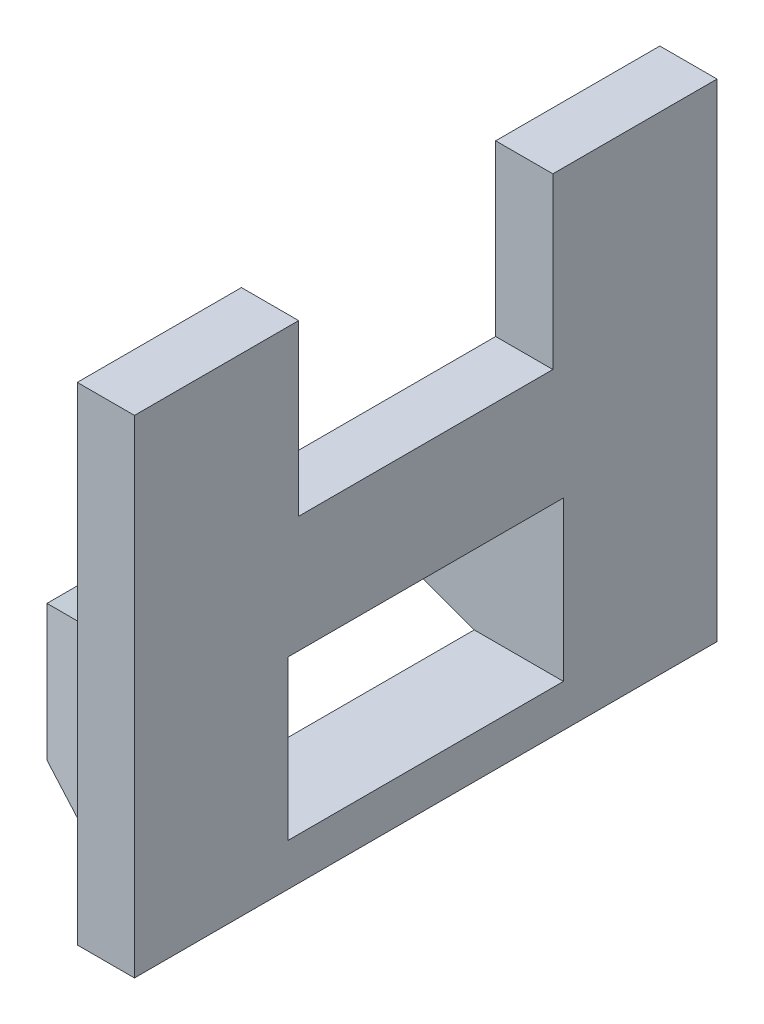
ISO-10303-21;
HEADER;
FILE_DESCRIPTION(('STEP AP214'),'2;1');
FILE_NAME('part.step','',(''),(''),'','','');
FILE_SCHEMA(('AUTOMOTIVE_DESIGN { 1 0 10303 214 1 1 1 1 }'));
ENDSEC;
DATA;
#1=APPLICATION_CONTEXT('core data for automotive mechanical design processes');
#2=APPLICATION_PROTOCOL_DEFINITION('international standard','automotive_design',2000,#1);
#3=PRODUCT_CONTEXT('',#1,'mechanical');
#4=PRODUCT('Part','Part','',(#3));
#5=PRODUCT_RELATED_PRODUCT_CATEGORY('part','',(#4));
#6=PRODUCT_DEFINITION_FORMATION('','',#4);
#7=PRODUCT_DEFINITION_CONTEXT('part definition',#1,'design');
#8=PRODUCT_DEFINITION('design','',#6,#7);
#9=PRODUCT_DEFINITION_SHAPE('','',#8);
#10=(LENGTH_UNIT() NAMED_UNIT(*) SI_UNIT(.MILLI.,.METRE.));
#11=(NAMED_UNIT(*) PLANE_ANGLE_UNIT() SI_UNIT($,.RADIAN.));
#12=(NAMED_UNIT(*) SI_UNIT($,.STERADIAN.) SOLID_ANGLE_UNIT());
#13=UNCERTAINTY_MEASURE_WITH_UNIT(LENGTH_MEASURE(1.E-05),#10,'distance_accuracy_value','');
#14=(GEOMETRIC_REPRESENTATION_CONTEXT(3) GLOBAL_UNCERTAINTY_ASSIGNED_CONTEXT((#13)) GLOBAL_UNIT_ASSIGNED_CONTEXT((#10,
#11,#12)) REPRESENTATION_CONTEXT('',''));
#15=CARTESIAN_POINT('',(0.,0.,0.));
#16=DIRECTION('',(0.,0.,1.));
#17=DIRECTION('',(1.,0.,0.));
#18=AXIS2_PLACEMENT_3D('',#15,#16,#17);
#19=CARTESIAN_POINT('',(-2.7,0.,0.));
#20=DIRECTION('',(1.,0.,0.));
#21=DIRECTION('',(0.,0.,-1.));
#22=AXIS2_PLACEMENT_3D('',#19,#20,#21);
#23=PLANE('',#22);
#24=DIRECTION('',(0.,0.,-1.));
#25=VECTOR('',#24,1.);
#26=CARTESIAN_POINT('',(-2.7,3.5,6.));
#27=LINE('',#26,#25);
#28=CARTESIAN_POINT('',(-2.7,3.5,6.));
#29=VERTEX_POINT('',#28);
#30=CARTESIAN_POINT('',(-2.7,3.5,-6.));
#31=VERTEX_POINT('',#30);
#32=EDGE_CURVE('E256',#29,#31,#27,.T.);
#33=ORIENTED_EDGE('',*,*,#32,.T.);
#34=DIRECTION('',(0.,1.,0.));
#35=VECTOR('',#34,1.);
#36=CARTESIAN_POINT('',(-2.7,3.5,-6.));
#37=LINE('',#36,#35);
#38=CARTESIAN_POINT('',(-2.7,11.5,-6.));
#39=VERTEX_POINT('',#38);
#40=EDGE_CURVE('E261',#31,#39,#37,.T.);
#41=ORIENTED_EDGE('',*,*,#40,.T.);
#42=DIRECTION('',(0.,0.,1.));
#43=VECTOR('',#42,1.);
#44=CARTESIAN_POINT('',(-2.7,11.5,13.75));
#45=LINE('',#44,#43);
#46=CARTESIAN_POINT('',(-2.7,11.5,-13.75));
#47=VERTEX_POINT('',#46);
#48=EDGE_CURVE('E294',#47,#39,#45,.T.);
#49=ORIENTED_EDGE('',*,*,#48,.F.);
#50=DIRECTION('',(0.,1.,0.));
#51=VECTOR('',#50,1.);
#52=CARTESIAN_POINT('',(-2.7,11.5,-13.75));
#53=LINE('',#52,#51);
#54=CARTESIAN_POINT('',(-2.7,-11.5,-13.75));
#55=VERTEX_POINT('',#54);
#56=EDGE_CURVE('E288',#55,#47,#53,.T.);
#57=ORIENTED_EDGE('',*,*,#56,.F.);
#58=DIRECTION('',(0.,0.,-1.));
#59=VECTOR('',#58,1.);
#60=CARTESIAN_POINT('',(-2.7,-11.5,13.75));
#61=LINE('',#60,#59);
#62=CARTESIAN_POINT('',(-2.7,-11.5,13.75));
#63=VERTEX_POINT('',#62);
#64=EDGE_CURVE('E302',#63,#55,#61,.T.);
#65=ORIENTED_EDGE('',*,*,#64,.F.);
#66=DIRECTION('',(0.,-1.,0.));
#67=VECTOR('',#66,1.);
#68=CARTESIAN_POINT('',(-2.7,11.5,13.75));
#69=LINE('',#68,#67);
#70=CARTESIAN_POINT('',(-2.7,11.5,13.75));
#71=VERTEX_POINT('',#70);
#72=EDGE_CURVE('E298',#71,#63,#69,.T.);
#73=ORIENTED_EDGE('',*,*,#72,.F.);
#74=CARTESIAN_POINT('',(-2.7,11.5,6.));
#75=VERTEX_POINT('',#74);
#76=EDGE_CURVE('E292',#75,#71,#45,.T.);
#77=ORIENTED_EDGE('',*,*,#76,.F.);
#78=DIRECTION('',(0.,-1.,0.));
#79=VECTOR('',#78,1.);
#80=CARTESIAN_POINT('',(-2.7,11.5,6.));
#81=LINE('',#80,#79);
#82=EDGE_CURVE('E252',#75,#29,#81,.T.);
#83=ORIENTED_EDGE('',*,*,#82,.T.);
#84=EDGE_LOOP('',(#33,#41,#49,#57,#65,#73,#77,#83));
#85=FACE_BOUND('',#84,.T.);
#86=DIRECTION('',(0.,-1.,0.));
#87=VECTOR('',#86,1.);
#88=CARTESIAN_POINT('',(-2.7,0.,-12.));
#89=LINE('',#88,#87);
#90=CARTESIAN_POINT('',(-2.7,0.,-12.));
#91=VERTEX_POINT('',#90);
#92=CARTESIAN_POINT('',(-2.7,-10.05,-12.));
#93=VERTEX_POINT('',#92);
#94=EDGE_CURVE('E204',#91,#93,#89,.T.);
#95=ORIENTED_EDGE('',*,*,#94,.F.);
#96=DIRECTION('',(0.,0.,-1.));
#97=VECTOR('',#96,1.);
#98=CARTESIAN_POINT('',(-2.7,0.,-12.));
#99=LINE('',#98,#97);
#100=CARTESIAN_POINT('',(-2.7,0.,12.));
#101=VERTEX_POINT('',#100);
#102=EDGE_CURVE('E216',#101,#91,#99,.T.);
#103=ORIENTED_EDGE('',*,*,#102,.F.);
#104=DIRECTION('',(0.,1.,0.));
#105=VECTOR('',#104,1.);
#106=CARTESIAN_POINT('',(-2.7,0.,12.));
#107=LINE('',#106,#105);
#108=CARTESIAN_POINT('',(-2.7,-10.05,12.));
#109=VERTEX_POINT('',#108);
#110=EDGE_CURVE('E212',#109,#101,#107,.T.);
#111=ORIENTED_EDGE('',*,*,#110,.F.);
#112=DIRECTION('',(0.,0.,1.));
#113=VECTOR('',#112,1.);
#114=CARTESIAN_POINT('',(-2.7,-10.05,-12.));
#115=LINE('',#114,#113);
#116=EDGE_CURVE('E208',#93,#109,#115,.T.);
#117=ORIENTED_EDGE('',*,*,#116,.F.);
#118=EDGE_LOOP('',(#95,#103,#111,#117));
#119=FACE_BOUND('',#118,.T.);
#120=ADVANCED_FACE('F39',(#85,#119),#23,.F.);
#121=CARTESIAN_POINT('',(-2.7,11.5,13.75));
#122=DIRECTION('',(0.,1.,0.));
#123=DIRECTION('',(0.,0.,1.));
#124=AXIS2_PLACEMENT_3D('',#121,#122,#123);
#125=PLANE('',#124);
#126=DIRECTION('',(1.,0.,0.));
#127=VECTOR('',#126,1.);
#128=CARTESIAN_POINT('',(-2.7,11.5,-6.));
#129=LINE('',#128,#127);
#130=CARTESIAN_POINT('',(0.,11.5,-6.));
#131=VERTEX_POINT('',#130);
#132=EDGE_CURVE('E275',#39,#131,#129,.T.);
#133=ORIENTED_EDGE('',*,*,#132,.T.);
#134=DIRECTION('',(0.,0.,1.));
#135=VECTOR('',#134,1.);
#136=CARTESIAN_POINT('',(0.,11.5,13.75));
#137=LINE('',#136,#135);
#138=CARTESIAN_POINT('',(0.,11.5,-13.75));
#139=VERTEX_POINT('',#138);
#140=EDGE_CURVE('E311',#139,#131,#137,.T.);
#141=ORIENTED_EDGE('',*,*,#140,.F.);
#142=DIRECTION('',(1.,0.,0.));
#143=VECTOR('',#142,1.);
#144=CARTESIAN_POINT('',(-2.7,11.5,-13.75));
#145=LINE('',#144,#143);
#146=EDGE_CURVE('E306',#47,#139,#145,.T.);
#147=ORIENTED_EDGE('',*,*,#146,.F.);
#148=ORIENTED_EDGE('',*,*,#48,.T.);
#149=EDGE_LOOP('',(#133,#141,#147,#148));
#150=FACE_BOUND('',#149,.T.);
#151=ADVANCED_FACE('F393',(#150),#125,.T.);
#152=CARTESIAN_POINT('',(-2.7,11.5,-13.75));
#153=DIRECTION('',(0.,0.,-1.));
#154=DIRECTION('',(0.,1.,0.));
#155=AXIS2_PLACEMENT_3D('',#152,#153,#154);
#156=PLANE('',#155);
#157=DIRECTION('',(0.,1.,0.));
#158=VECTOR('',#157,1.);
#159=CARTESIAN_POINT('',(0.,11.5,-13.75));
#160=LINE('',#159,#158);
#161=CARTESIAN_POINT('',(0.,-11.5,-13.75));
#162=VERTEX_POINT('',#161);
#163=EDGE_CURVE('E279',#162,#139,#160,.T.);
#164=ORIENTED_EDGE('',*,*,#163,.F.);
#165=DIRECTION('',(1.,0.,0.));
#166=VECTOR('',#165,1.);
#167=CARTESIAN_POINT('',(-2.7,-11.5,-13.75));
#168=LINE('',#167,#166);
#169=EDGE_CURVE('E322',#55,#162,#168,.T.);
#170=ORIENTED_EDGE('',*,*,#169,.F.);
#171=ORIENTED_EDGE('',*,*,#56,.T.);
#172=ORIENTED_EDGE('',*,*,#146,.T.);
#173=EDGE_LOOP('',(#164,#170,#171,#172));
#174=FACE_BOUND('',#173,.T.);
#175=ADVANCED_FACE('F41',(#174),#156,.T.);
#176=CARTESIAN_POINT('',(-2.7,-11.5,13.75));
#177=DIRECTION('',(0.,-1.,0.));
#178=DIRECTION('',(0.,0.,-1.));
#179=AXIS2_PLACEMENT_3D('',#176,#177,#178);
#180=PLANE('',#179);
#181=DIRECTION('',(0.,0.,-1.));
#182=VECTOR('',#181,1.);
#183=CARTESIAN_POINT('',(0.,-11.5,13.75));
#184=LINE('',#183,#182);
#185=CARTESIAN_POINT('',(0.,-11.5,13.75));
#186=VERTEX_POINT('',#185);
#187=EDGE_CURVE('E293',#186,#162,#184,.T.);
#188=ORIENTED_EDGE('',*,*,#187,.F.);
#189=DIRECTION('',(1.,0.,0.));
#190=VECTOR('',#189,1.);
#191=CARTESIAN_POINT('',(-2.7,-11.5,13.75));
#192=LINE('',#191,#190);
#193=EDGE_CURVE('E326',#63,#186,#192,.T.);
#194=ORIENTED_EDGE('',*,*,#193,.F.);
#195=ORIENTED_EDGE('',*,*,#64,.T.);
#196=ORIENTED_EDGE('',*,*,#169,.T.);
#197=EDGE_LOOP('',(#188,#194,#195,#196));
#198=FACE_BOUND('',#197,.T.);
#199=ADVANCED_FACE('F378',(#198),#180,.T.);
#200=CARTESIAN_POINT('',(-2.7,11.5,13.75));
#201=DIRECTION('',(0.,0.,1.));
#202=DIRECTION('',(0.,-1.,0.));
#203=AXIS2_PLACEMENT_3D('',#200,#201,#202);
#204=PLANE('',#203);
#205=DIRECTION('',(0.,-1.,0.));
#206=VECTOR('',#205,1.);
#207=CARTESIAN_POINT('',(0.,11.5,13.75));
#208=LINE('',#207,#206);
#209=CARTESIAN_POINT('',(0.,11.5,13.75));
#210=VERTEX_POINT('',#209);
#211=EDGE_CURVE('E315',#210,#186,#208,.T.);
#212=ORIENTED_EDGE('',*,*,#211,.F.);
#213=DIRECTION('',(1.,0.,0.));
#214=VECTOR('',#213,1.);
#215=CARTESIAN_POINT('',(-2.7,11.5,13.75));
#216=LINE('',#215,#214);
#217=EDGE_CURVE('E329',#71,#210,#216,.T.);
#218=ORIENTED_EDGE('',*,*,#217,.F.);
#219=ORIENTED_EDGE('',*,*,#72,.T.);
#220=ORIENTED_EDGE('',*,*,#193,.T.);
#221=EDGE_LOOP('',(#212,#218,#219,#220));
#222=FACE_BOUND('',#221,.T.);
#223=ADVANCED_FACE('F372',(#222),#204,.T.);
#224=DIRECTION('',(1.,0.,0.));
#225=VECTOR('',#224,1.);
#226=CARTESIAN_POINT('',(-2.7,11.5,6.));
#227=LINE('',#226,#225);
#228=CARTESIAN_POINT('',(0.,11.5,6.));
#229=VERTEX_POINT('',#228);
#230=EDGE_CURVE('E265',#75,#229,#227,.T.);
#231=ORIENTED_EDGE('',*,*,#230,.F.);
#232=ORIENTED_EDGE('',*,*,#76,.T.);
#233=ORIENTED_EDGE('',*,*,#217,.T.);
#234=EDGE_CURVE('E310',#229,#210,#137,.T.);
#235=ORIENTED_EDGE('',*,*,#234,.F.);
#236=EDGE_LOOP('',(#231,#232,#233,#235));
#237=FACE_BOUND('',#236,.T.);
#238=ADVANCED_FACE('F366',(#237),#125,.T.);
#239=CARTESIAN_POINT('',(0.,0.,0.));
#240=DIRECTION('',(1.,0.,0.));
#241=DIRECTION('',(0.,0.,-1.));
#242=AXIS2_PLACEMENT_3D('',#239,#240,#241);
#243=PLANE('',#242);
#244=DIRECTION('',(0.,0.,-1.));
#245=VECTOR('',#244,1.);
#246=CARTESIAN_POINT('',(0.,-9.49999999999999,6.5));
#247=LINE('',#246,#245);
#248=CARTESIAN_POINT('',(0.,-9.49999999999999,6.5));
#249=VERTEX_POINT('',#248);
#250=CARTESIAN_POINT('',(0.,-9.49999999999999,-6.5));
#251=VERTEX_POINT('',#250);
#252=EDGE_CURVE('E165',#249,#251,#247,.T.);
#253=ORIENTED_EDGE('',*,*,#252,.F.);
#254=DIRECTION('',(0.,1.,0.));
#255=VECTOR('',#254,1.);
#256=CARTESIAN_POINT('',(0.,-9.49999999999999,6.5));
#257=LINE('',#256,#255);
#258=CARTESIAN_POINT('',(0.,-1.99999999999999,6.5));
#259=VERTEX_POINT('',#258);
#260=EDGE_CURVE('E168',#249,#259,#257,.T.);
#261=ORIENTED_EDGE('',*,*,#260,.T.);
#262=DIRECTION('',(0.,0.,-1.));
#263=VECTOR('',#262,1.);
#264=CARTESIAN_POINT('',(0.,-1.99999999999999,6.5));
#265=LINE('',#264,#263);
#266=CARTESIAN_POINT('',(0.,-1.99999999999999,-6.5));
#267=VERTEX_POINT('',#266);
#268=EDGE_CURVE('E55',#259,#267,#265,.T.);
#269=ORIENTED_EDGE('',*,*,#268,.T.);
#270=DIRECTION('',(0.,1.,0.));
#271=VECTOR('',#270,1.);
#272=CARTESIAN_POINT('',(0.,-9.49999999999999,-6.5));
#273=LINE('',#272,#271);
#274=EDGE_CURVE('E179',#251,#267,#273,.T.);
#275=ORIENTED_EDGE('',*,*,#274,.F.);
#276=EDGE_LOOP('',(#253,#261,#269,#275));
#277=FACE_BOUND('',#276,.T.);
#278=DIRECTION('',(0.,1.,0.));
#279=VECTOR('',#278,1.);
#280=CARTESIAN_POINT('',(0.,3.5,-6.));
#281=LINE('',#280,#279);
#282=CARTESIAN_POINT('',(0.,3.5,-6.));
#283=VERTEX_POINT('',#282);
#284=EDGE_CURVE('E257',#283,#131,#281,.T.);
#285=ORIENTED_EDGE('',*,*,#284,.F.);
#286=DIRECTION('',(0.,0.,-1.));
#287=VECTOR('',#286,1.);
#288=CARTESIAN_POINT('',(0.,3.5,6.));
#289=LINE('',#288,#287);
#290=CARTESIAN_POINT('',(0.,3.5,6.));
#291=VERTEX_POINT('',#290);
#292=EDGE_CURVE('E269',#291,#283,#289,.T.);
#293=ORIENTED_EDGE('',*,*,#292,.F.);
#294=DIRECTION('',(0.,-1.,0.));
#295=VECTOR('',#294,1.);
#296=CARTESIAN_POINT('',(0.,11.5,6.));
#297=LINE('',#296,#295);
#298=EDGE_CURVE('E225',#229,#291,#297,.T.);
#299=ORIENTED_EDGE('',*,*,#298,.F.);
#300=ORIENTED_EDGE('',*,*,#234,.T.);
#301=ORIENTED_EDGE('',*,*,#211,.T.);
#302=ORIENTED_EDGE('',*,*,#187,.T.);
#303=ORIENTED_EDGE('',*,*,#163,.T.);
#304=ORIENTED_EDGE('',*,*,#140,.T.);
#305=EDGE_LOOP('',(#285,#293,#299,#300,#301,#302,#303,#304));
#306=FACE_BOUND('',#305,.T.);
#307=ADVANCED_FACE('F176',(#277,#306),#243,.T.);
#308=CARTESIAN_POINT('',(-2.7,3.5,-6.));
#309=DIRECTION('',(0.,0.,-1.));
#310=DIRECTION('',(-1.,0.,0.));
#311=AXIS2_PLACEMENT_3D('',#308,#309,#310);
#312=PLANE('',#311);
#313=ORIENTED_EDGE('',*,*,#284,.T.);
#314=ORIENTED_EDGE('',*,*,#132,.F.);
#315=ORIENTED_EDGE('',*,*,#40,.F.);
#316=DIRECTION('',(1.,0.,0.));
#317=VECTOR('',#316,1.);
#318=CARTESIAN_POINT('',(-2.7,3.5,-6.));
#319=LINE('',#318,#317);
#320=EDGE_CURVE('E280',#31,#283,#319,.T.);
#321=ORIENTED_EDGE('',*,*,#320,.T.);
#322=EDGE_LOOP('',(#313,#314,#315,#321));
#323=FACE_BOUND('',#322,.T.);
#324=ADVANCED_FACE('F390',(#323),#312,.F.);
#325=CARTESIAN_POINT('',(-2.7,3.5,6.));
#326=DIRECTION('',(0.,-1.,0.));
#327=DIRECTION('',(0.,0.,-1.));
#328=AXIS2_PLACEMENT_3D('',#325,#326,#327);
#329=PLANE('',#328);
#330=ORIENTED_EDGE('',*,*,#292,.T.);
#331=ORIENTED_EDGE('',*,*,#320,.F.);
#332=ORIENTED_EDGE('',*,*,#32,.F.);
#333=DIRECTION('',(1.,0.,0.));
#334=VECTOR('',#333,1.);
#335=CARTESIAN_POINT('',(-2.7,3.5,6.));
#336=LINE('',#335,#334);
#337=EDGE_CURVE('E283',#29,#291,#336,.T.);
#338=ORIENTED_EDGE('',*,*,#337,.T.);
#339=EDGE_LOOP('',(#330,#331,#332,#338));
#340=FACE_BOUND('',#339,.T.);
#341=ADVANCED_FACE('F388',(#340),#329,.F.);
#342=CARTESIAN_POINT('',(-2.7,11.5,6.));
#343=DIRECTION('',(0.,0.,1.));
#344=DIRECTION('',(0.,-1.,0.));
#345=AXIS2_PLACEMENT_3D('',#342,#343,#344);
#346=PLANE('',#345);
#347=ORIENTED_EDGE('',*,*,#298,.T.);
#348=ORIENTED_EDGE('',*,*,#337,.F.);
#349=ORIENTED_EDGE('',*,*,#82,.F.);
#350=ORIENTED_EDGE('',*,*,#230,.T.);
#351=EDGE_LOOP('',(#347,#348,#349,#350));
#352=FACE_BOUND('',#351,.T.);
#353=ADVANCED_FACE('F384',(#352),#346,.F.);
#354=CARTESIAN_POINT('',(-2.7,0.,-12.));
#355=DIRECTION('',(-0.342020143325669,0.,-0.939692620785908));
#356=DIRECTION('',(-0.939692620785908,0.,0.342020143325669));
#357=AXIS2_PLACEMENT_3D('',#354,#355,#356);
#358=PLANE('',#357);
#359=ORIENTED_EDGE('',*,*,#94,.T.);
#360=DIRECTION('',(0.889126490715988,-0.323615577118185,-0.323615577118185));
#361=VECTOR('',#360,1.);
#362=CARTESIAN_POINT('',(-2.7,-10.05,-12.));
#363=LINE('',#362,#361);
#364=CARTESIAN_POINT('',(-7.7,-8.23014882866898,-10.180148828669));
#365=VERTEX_POINT('',#364);
#366=EDGE_CURVE('E221',#365,#93,#363,.T.);
#367=ORIENTED_EDGE('',*,*,#366,.F.);
#368=DIRECTION('',(0.,1.,0.));
#369=VECTOR('',#368,1.);
#370=CARTESIAN_POINT('',(-7.7,0.,-10.180148828669));
#371=LINE('',#370,#369);
#372=CARTESIAN_POINT('',(-7.7,-1.81985117133102,-10.180148828669));
#373=VERTEX_POINT('',#372);
#374=EDGE_CURVE('E220',#373,#365,#371,.F.);
#375=ORIENTED_EDGE('',*,*,#374,.F.);
#376=DIRECTION('',(0.889126490715988,0.323615577118185,-0.323615577118185));
#377=VECTOR('',#376,1.);
#378=CARTESIAN_POINT('',(-2.7,0.,-12.));
#379=LINE('',#378,#377);
#380=EDGE_CURVE('E227',#373,#91,#379,.T.);
#381=ORIENTED_EDGE('',*,*,#380,.T.);
#382=EDGE_LOOP('',(#359,#367,#375,#381));
#383=FACE_BOUND('',#382,.T.);
#384=ADVANCED_FACE('F351',(#383),#358,.T.);
#385=CARTESIAN_POINT('',(-2.7,-10.05,-12.));
#386=DIRECTION('',(-0.342020143325669,-0.939692620785908,0.));
#387=DIRECTION('',(0.939692620785908,-0.342020143325669,0.));
#388=AXIS2_PLACEMENT_3D('',#385,#386,#387);
#389=PLANE('',#388);
#390=DIRECTION('',(0.,0.,1.));
#391=VECTOR('',#390,1.);
#392=CARTESIAN_POINT('',(-4.21111258070004,-9.49999999999999,-12.));
#393=LINE('',#392,#391);
#394=CARTESIAN_POINT('',(-4.21111258070003,-9.49999999999999,6.5));
#395=VERTEX_POINT('',#394);
#396=CARTESIAN_POINT('',(-4.21111258070003,-9.49999999999999,-6.5));
#397=VERTEX_POINT('',#396);
#398=EDGE_CURVE('E11',#395,#397,#393,.F.);
#399=ORIENTED_EDGE('',*,*,#398,.T.);
#400=DIRECTION('',(0.939692620785908,-0.342020143325669,0.));
#401=VECTOR('',#400,1.);
#402=CARTESIAN_POINT('',(-2.7,-10.05,-6.5));
#403=LINE('',#402,#401);
#404=CARTESIAN_POINT('',(-7.7,-8.23014882866898,-6.5));
#405=VERTEX_POINT('',#404);
#406=EDGE_CURVE('E200',#397,#405,#403,.F.);
#407=ORIENTED_EDGE('',*,*,#406,.T.);
#408=DIRECTION('',(0.,0.,-1.));
#409=VECTOR('',#408,1.);
#410=CARTESIAN_POINT('',(-7.7,-8.23014882866898,-12.));
#411=LINE('',#410,#409);
#412=EDGE_CURVE('E243',#365,#405,#411,.F.);
#413=ORIENTED_EDGE('',*,*,#412,.F.);
#414=ORIENTED_EDGE('',*,*,#366,.T.);
#415=ORIENTED_EDGE('',*,*,#116,.T.);
#416=DIRECTION('',(0.889126490715988,-0.323615577118185,0.323615577118185));
#417=VECTOR('',#416,1.);
#418=CARTESIAN_POINT('',(-5.59173858336242,-8.99749323037696,10.947493230377));
#419=LINE('',#418,#417);
#420=CARTESIAN_POINT('',(-7.7,-8.23014882866898,10.180148828669));
#421=VERTEX_POINT('',#420);
#422=EDGE_CURVE('E226',#421,#109,#419,.T.);
#423=ORIENTED_EDGE('',*,*,#422,.F.);
#424=CARTESIAN_POINT('',(-7.7,-8.23014882866898,6.5));
#425=VERTEX_POINT('',#424);
#426=EDGE_CURVE('E242',#425,#421,#411,.F.);
#427=ORIENTED_EDGE('',*,*,#426,.F.);
#428=DIRECTION('',(0.939692620785908,-0.342020143325669,0.));
#429=VECTOR('',#428,1.);
#430=CARTESIAN_POINT('',(-2.7,-10.05,6.5));
#431=LINE('',#430,#429);
#432=EDGE_CURVE('E63',#395,#425,#431,.F.);
#433=ORIENTED_EDGE('',*,*,#432,.F.);
#434=EDGE_LOOP('',(#399,#407,#413,#414,#415,#423,#427,#433));
#435=FACE_BOUND('',#434,.T.);
#436=ADVANCED_FACE('F344',(#435),#389,.T.);
#437=CARTESIAN_POINT('',(-2.7,0.,12.));
#438=DIRECTION('',(-0.342020143325669,0.,0.939692620785908));
#439=DIRECTION('',(0.939692620785908,0.,0.342020143325669));
#440=AXIS2_PLACEMENT_3D('',#437,#438,#439);
#441=PLANE('',#440);
#442=ORIENTED_EDGE('',*,*,#110,.T.);
#443=DIRECTION('',(0.889126490715988,0.323615577118185,0.323615577118185));
#444=VECTOR('',#443,1.);
#445=CARTESIAN_POINT('',(-9.60564437817891,-2.51344900208487,9.48655099791514));
#446=LINE('',#445,#444);
#447=CARTESIAN_POINT('',(-7.7,-1.81985117133102,10.180148828669));
#448=VERTEX_POINT('',#447);
#449=EDGE_CURVE('E231',#448,#101,#446,.T.);
#450=ORIENTED_EDGE('',*,*,#449,.F.);
#451=DIRECTION('',(0.,-1.,0.));
#452=VECTOR('',#451,1.);
#453=CARTESIAN_POINT('',(-7.7,0.,10.180148828669));
#454=LINE('',#453,#452);
#455=EDGE_CURVE('E247',#421,#448,#454,.F.);
#456=ORIENTED_EDGE('',*,*,#455,.F.);
#457=ORIENTED_EDGE('',*,*,#422,.T.);
#458=EDGE_LOOP('',(#442,#450,#456,#457));
#459=FACE_BOUND('',#458,.T.);
#460=ADVANCED_FACE('F357',(#459),#441,.T.);
#461=CARTESIAN_POINT('',(-2.7,0.,-12.));
#462=DIRECTION('',(-0.342020143325669,0.939692620785908,0.));
#463=DIRECTION('',(-0.939692620785908,-0.342020143325669,0.));
#464=AXIS2_PLACEMENT_3D('',#461,#462,#463);
#465=PLANE('',#464);
#466=ORIENTED_EDGE('',*,*,#102,.T.);
#467=ORIENTED_EDGE('',*,*,#380,.F.);
#468=DIRECTION('',(0.,0.,1.));
#469=VECTOR('',#468,1.);
#470=CARTESIAN_POINT('',(-7.7,-1.81985117133102,-12.));
#471=LINE('',#470,#469);
#472=EDGE_CURVE('E232',#448,#373,#471,.F.);
#473=ORIENTED_EDGE('',*,*,#472,.F.);
#474=ORIENTED_EDGE('',*,*,#449,.T.);
#475=EDGE_LOOP('',(#466,#467,#473,#474));
#476=FACE_BOUND('',#475,.T.);
#477=ADVANCED_FACE('F457',(#476),#465,.T.);
#478=CARTESIAN_POINT('',(-7.7,0.,0.));
#479=DIRECTION('',(-1.,0.,0.));
#480=DIRECTION('',(0.,0.,1.));
#481=AXIS2_PLACEMENT_3D('',#478,#479,#480);
#482=PLANE('',#481);
#483=DIRECTION('',(0.,-1.,0.));
#484=VECTOR('',#483,1.);
#485=CARTESIAN_POINT('',(-7.7,0.,-6.5));
#486=LINE('',#485,#484);
#487=CARTESIAN_POINT('',(-7.7,-1.99999999999999,-6.5));
#488=VERTEX_POINT('',#487);
#489=EDGE_CURVE('E48',#488,#405,#486,.T.);
#490=ORIENTED_EDGE('',*,*,#489,.F.);
#491=DIRECTION('',(0.,0.,-1.));
#492=VECTOR('',#491,1.);
#493=CARTESIAN_POINT('',(-7.7,-1.99999999999999,6.5));
#494=LINE('',#493,#492);
#495=CARTESIAN_POINT('',(-7.7,-1.99999999999999,6.5));
#496=VERTEX_POINT('',#495);
#497=EDGE_CURVE('E181',#496,#488,#494,.T.);
#498=ORIENTED_EDGE('',*,*,#497,.F.);
#499=DIRECTION('',(0.,-1.,0.));
#500=VECTOR('',#499,1.);
#501=CARTESIAN_POINT('',(-7.7,0.,6.5));
#502=LINE('',#501,#500);
#503=EDGE_CURVE('E325',#496,#425,#502,.T.);
#504=ORIENTED_EDGE('',*,*,#503,.T.);
#505=ORIENTED_EDGE('',*,*,#426,.T.);
#506=ORIENTED_EDGE('',*,*,#455,.T.);
#507=ORIENTED_EDGE('',*,*,#472,.T.);
#508=ORIENTED_EDGE('',*,*,#374,.T.);
#509=ORIENTED_EDGE('',*,*,#412,.T.);
#510=EDGE_LOOP('',(#490,#498,#504,#505,#506,#507,#508,#509));
#511=FACE_BOUND('',#510,.T.);
#512=ADVANCED_FACE('F345',(#511),#482,.T.);
#513=CARTESIAN_POINT('',(-22.7083310198036,-9.49999999999999,6.5));
#514=DIRECTION('',(0.,-1.,0.));
#515=DIRECTION('',(0.,0.,-1.));
#516=AXIS2_PLACEMENT_3D('',#513,#514,#515);
#517=PLANE('',#516);
#518=DIRECTION('',(1.,0.,0.));
#519=VECTOR('',#518,1.);
#520=CARTESIAN_POINT('',(-22.7083310198036,-9.49999999999999,6.5));
#521=LINE('',#520,#519);
#522=EDGE_CURVE('E160',#395,#249,#521,.T.);
#523=ORIENTED_EDGE('',*,*,#522,.T.);
#524=ORIENTED_EDGE('',*,*,#252,.T.);
#525=DIRECTION('',(1.,0.,0.));
#526=VECTOR('',#525,1.);
#527=CARTESIAN_POINT('',(-22.7083310198036,-9.49999999999999,-6.5));
#528=LINE('',#527,#526);
#529=EDGE_CURVE('E185',#397,#251,#528,.T.);
#530=ORIENTED_EDGE('',*,*,#529,.F.);
#531=ORIENTED_EDGE('',*,*,#398,.F.);
#532=EDGE_LOOP('',(#523,#524,#530,#531));
#533=FACE_BOUND('',#532,.T.);
#534=ADVANCED_FACE('F162',(#533),#517,.F.);
#535=CARTESIAN_POINT('',(-22.7083310198036,-9.49999999999999,-6.5));
#536=DIRECTION('',(0.,0.,-1.));
#537=DIRECTION('',(-1.,0.,0.));
#538=AXIS2_PLACEMENT_3D('',#535,#536,#537);
#539=PLANE('',#538);
#540=ORIENTED_EDGE('',*,*,#529,.T.);
#541=ORIENTED_EDGE('',*,*,#274,.T.);
#542=DIRECTION('',(1.,0.,0.));
#543=VECTOR('',#542,1.);
#544=CARTESIAN_POINT('',(-22.7083310198036,-1.99999999999999,-6.5));
#545=LINE('',#544,#543);
#546=EDGE_CURVE('E193',#488,#267,#545,.T.);
#547=ORIENTED_EDGE('',*,*,#546,.F.);
#548=ORIENTED_EDGE('',*,*,#489,.T.);
#549=ORIENTED_EDGE('',*,*,#406,.F.);
#550=EDGE_LOOP('',(#540,#541,#547,#548,#549));
#551=FACE_BOUND('',#550,.T.);
#552=ADVANCED_FACE('F340',(#551),#539,.F.);
#553=CARTESIAN_POINT('',(-22.7083310198036,-9.49999999999999,6.5));
#554=DIRECTION('',(0.,0.,-1.));
#555=DIRECTION('',(-1.,0.,0.));
#556=AXIS2_PLACEMENT_3D('',#553,#554,#555);
#557=PLANE('',#556);
#558=ORIENTED_EDGE('',*,*,#432,.T.);
#559=ORIENTED_EDGE('',*,*,#503,.F.);
#560=DIRECTION('',(1.,0.,0.));
#561=VECTOR('',#560,1.);
#562=CARTESIAN_POINT('',(-22.7083310198036,-1.99999999999999,6.5));
#563=LINE('',#562,#561);
#564=EDGE_CURVE('E172',#496,#259,#563,.T.);
#565=ORIENTED_EDGE('',*,*,#564,.T.);
#566=ORIENTED_EDGE('',*,*,#260,.F.);
#567=ORIENTED_EDGE('',*,*,#522,.F.);
#568=EDGE_LOOP('',(#558,#559,#565,#566,#567));
#569=FACE_BOUND('',#568,.T.);
#570=ADVANCED_FACE('F171',(#569),#557,.T.);
#571=CARTESIAN_POINT('',(-22.7083310198036,-1.99999999999999,6.5));
#572=DIRECTION('',(0.,-1.,0.));
#573=DIRECTION('',(0.,0.,-1.));
#574=AXIS2_PLACEMENT_3D('',#571,#572,#573);
#575=PLANE('',#574);
#576=ORIENTED_EDGE('',*,*,#497,.T.);
#577=ORIENTED_EDGE('',*,*,#546,.T.);
#578=ORIENTED_EDGE('',*,*,#268,.F.);
#579=ORIENTED_EDGE('',*,*,#564,.F.);
#580=EDGE_LOOP('',(#576,#577,#578,#579));
#581=FACE_BOUND('',#580,.T.);
#582=ADVANCED_FACE('F487',(#581),#575,.T.);
#583=CLOSED_SHELL('',(#120,#151,#175,#199,#223,#238,#307,#324,#341,#353,#384,#436,#460,#477,
#512,#534,#552,#570,#582));
#584=MANIFOLD_SOLID_BREP('B2',#583);
#585=ADVANCED_BREP_SHAPE_REPRESENTATION('',(#18,#584),#14);
#586=SHAPE_DEFINITION_REPRESENTATION(#9,#585);
ENDSEC;
END-ISO-10303-21;
